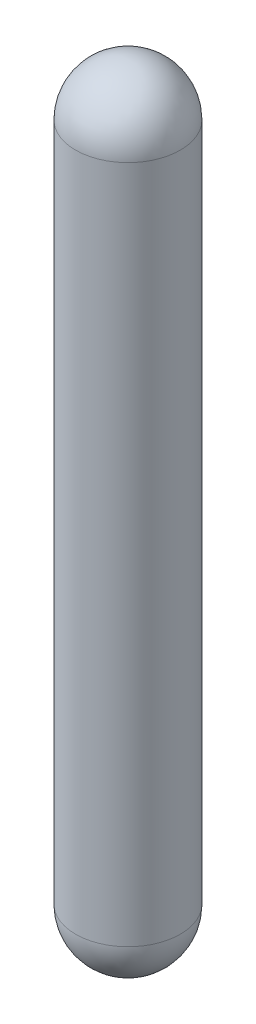
ISO-10303-21;
HEADER;
FILE_DESCRIPTION(('STEP AP214'),'2;1');
FILE_NAME('part.step','',(''),(''),'','','');
FILE_SCHEMA(('AUTOMOTIVE_DESIGN { 1 0 10303 214 1 1 1 1 }'));
ENDSEC;
DATA;
#1=APPLICATION_CONTEXT('core data for automotive mechanical design processes');
#2=APPLICATION_PROTOCOL_DEFINITION('international standard','automotive_design',2000,#1);
#3=PRODUCT_CONTEXT('',#1,'mechanical');
#4=PRODUCT('Part','Part','',(#3));
#5=PRODUCT_RELATED_PRODUCT_CATEGORY('part','',(#4));
#6=PRODUCT_DEFINITION_FORMATION('','',#4);
#7=PRODUCT_DEFINITION_CONTEXT('part definition',#1,'design');
#8=PRODUCT_DEFINITION('design','',#6,#7);
#9=PRODUCT_DEFINITION_SHAPE('','',#8);
#10=(LENGTH_UNIT() NAMED_UNIT(*) SI_UNIT(.MILLI.,.METRE.));
#11=(NAMED_UNIT(*) PLANE_ANGLE_UNIT() SI_UNIT($,.RADIAN.));
#12=(NAMED_UNIT(*) SI_UNIT($,.STERADIAN.) SOLID_ANGLE_UNIT());
#13=UNCERTAINTY_MEASURE_WITH_UNIT(LENGTH_MEASURE(1.E-05),#10,'distance_accuracy_value','');
#14=(GEOMETRIC_REPRESENTATION_CONTEXT(3) GLOBAL_UNCERTAINTY_ASSIGNED_CONTEXT((#13)) GLOBAL_UNIT_ASSIGNED_CONTEXT((#10,
#11,#12)) REPRESENTATION_CONTEXT('',''));
#15=CARTESIAN_POINT('',(0.,0.,0.));
#16=DIRECTION('',(0.,0.,1.));
#17=DIRECTION('',(1.,0.,0.));
#18=AXIS2_PLACEMENT_3D('',#15,#16,#17);
#19=CARTESIAN_POINT('',(0.,50.3580155806544,0.));
#20=DIRECTION('',(0.,1.,0.));
#21=DIRECTION('',(0.,0.,1.));
#22=AXIS2_PLACEMENT_3D('',#19,#20,#21);
#23=CYLINDRICAL_SURFACE('',#22,133.35);
#24=CARTESIAN_POINT('',(0.,1729.74,0.));
#25=DIRECTION('',(0.,1.,0.));
#26=DIRECTION('',(0.,0.,1.));
#27=AXIS2_PLACEMENT_3D('',#24,#25,#26);
#28=CIRCLE('',#27,133.35);
#29=CARTESIAN_POINT('',(0.,1729.74,133.35));
#30=VERTEX_POINT('',#29);
#31=EDGE_CURVE('E71',#30,#30,#28,.T.);
#32=ORIENTED_EDGE('',*,*,#31,.F.);
#33=EDGE_LOOP('',(#32));
#34=FACE_BOUND('',#33,.T.);
#35=CARTESIAN_POINT('',(0.,0.,0.));
#36=DIRECTION('',(0.,1.,0.));
#37=DIRECTION('',(0.,0.,1.));
#38=AXIS2_PLACEMENT_3D('',#35,#36,#37);
#39=CIRCLE('',#38,133.35);
#40=CARTESIAN_POINT('',(0.,0.,133.35));
#41=VERTEX_POINT('',#40);
#42=EDGE_CURVE('E11',#41,#41,#39,.T.);
#43=ORIENTED_EDGE('',*,*,#42,.T.);
#44=EDGE_LOOP('',(#43));
#45=FACE_BOUND('',#44,.T.);
#46=ADVANCED_FACE('F49',(#34,#45),#23,.T.);
#47=CARTESIAN_POINT('',(0.,0.,0.));
#48=DIRECTION('',(0.,1.,0.));
#49=DIRECTION('',(-1.,0.,0.));
#50=AXIS2_PLACEMENT_3D('',#47,#48,#49);
#51=SPHERICAL_SURFACE('',#50,133.35);
#52=CARTESIAN_POINT('',(0.,-133.198723717609,0.));
#53=DIRECTION('',(0.,1.,0.));
#54=DIRECTION('',(0.,0.,1.));
#55=AXIS2_PLACEMENT_3D('',#52,#53,#54);
#56=CIRCLE('',#55,6.34999999999997);
#57=CARTESIAN_POINT('',(0.,-133.198723717609,6.34999999999997));
#58=VERTEX_POINT('',#57);
#59=EDGE_CURVE('E55',#58,#58,#56,.T.);
#60=ORIENTED_EDGE('',*,*,#59,.T.);
#61=EDGE_LOOP('',(#60));
#62=FACE_BOUND('',#61,.T.);
#63=ORIENTED_EDGE('',*,*,#42,.F.);
#64=EDGE_LOOP('',(#63));
#65=FACE_BOUND('',#64,.T.);
#66=ADVANCED_FACE('F78',(#62,#65),#51,.T.);
#67=CARTESIAN_POINT('',(0.,50.3580155806544,0.));
#68=DIRECTION('',(0.,1.,0.));
#69=DIRECTION('',(0.,0.,1.));
#70=AXIS2_PLACEMENT_3D('',#67,#68,#69);
#71=CYLINDRICAL_SURFACE('',#70,6.34999999999997);
#72=CARTESIAN_POINT('',(0.,-129.867447848797,0.));
#73=DIRECTION('',(0.,1.,0.));
#74=DIRECTION('',(0.,0.,1.));
#75=AXIS2_PLACEMENT_3D('',#72,#73,#74);
#76=CIRCLE('',#75,6.34999999999997);
#77=CARTESIAN_POINT('',(0.,-129.867447848797,6.34999999999997));
#78=VERTEX_POINT('',#77);
#79=EDGE_CURVE('E59',#78,#78,#76,.T.);
#80=ORIENTED_EDGE('',*,*,#79,.T.);
#81=EDGE_LOOP('',(#80));
#82=FACE_BOUND('',#81,.T.);
#83=ORIENTED_EDGE('',*,*,#59,.F.);
#84=EDGE_LOOP('',(#83));
#85=FACE_BOUND('',#84,.T.);
#86=ADVANCED_FACE('F82',(#82,#85),#71,.F.);
#87=CARTESIAN_POINT('',(0.,0.,0.));
#88=DIRECTION('',(0.,1.,0.));
#89=DIRECTION('',(-1.,0.,0.));
#90=AXIS2_PLACEMENT_3D('',#87,#88,#89);
#91=SPHERICAL_SURFACE('',#90,130.0226);
#92=ORIENTED_EDGE('',*,*,#79,.F.);
#93=EDGE_LOOP('',(#92));
#94=FACE_BOUND('',#93,.T.);
#95=CARTESIAN_POINT('',(0.,0.,0.));
#96=DIRECTION('',(0.,1.,0.));
#97=DIRECTION('',(0.,0.,1.));
#98=AXIS2_PLACEMENT_3D('',#95,#96,#97);
#99=CIRCLE('',#98,130.0226);
#100=CARTESIAN_POINT('',(0.,0.,130.0226));
#101=VERTEX_POINT('',#100);
#102=EDGE_CURVE('E63',#101,#101,#99,.T.);
#103=ORIENTED_EDGE('',*,*,#102,.T.);
#104=EDGE_LOOP('',(#103));
#105=FACE_BOUND('',#104,.T.);
#106=ADVANCED_FACE('F86',(#94,#105),#91,.F.);
#107=CARTESIAN_POINT('',(0.,50.3580155806544,0.));
#108=DIRECTION('',(0.,1.,0.));
#109=DIRECTION('',(0.,0.,1.));
#110=AXIS2_PLACEMENT_3D('',#107,#108,#109);
#111=CYLINDRICAL_SURFACE('',#110,130.0226);
#112=ORIENTED_EDGE('',*,*,#102,.F.);
#113=EDGE_LOOP('',(#112));
#114=FACE_BOUND('',#113,.T.);
#115=CARTESIAN_POINT('',(0.,1729.74,0.));
#116=DIRECTION('',(0.,1.,0.));
#117=DIRECTION('',(0.,0.,1.));
#118=AXIS2_PLACEMENT_3D('',#115,#116,#117);
#119=CIRCLE('',#118,130.0226);
#120=CARTESIAN_POINT('',(0.,1729.74,130.0226));
#121=VERTEX_POINT('',#120);
#122=EDGE_CURVE('E68',#121,#121,#119,.T.);
#123=ORIENTED_EDGE('',*,*,#122,.T.);
#124=EDGE_LOOP('',(#123));
#125=FACE_BOUND('',#124,.T.);
#126=ADVANCED_FACE('F93',(#114,#125),#111,.F.);
#127=CARTESIAN_POINT('',(-2.08166817117217E-13,1729.74,0.));
#128=DIRECTION('',(0.,1.,0.));
#129=DIRECTION('',(-1.,0.,0.));
#130=AXIS2_PLACEMENT_3D('',#127,#128,#129);
#131=SPHERICAL_SURFACE('',#130,130.0226);
#132=ORIENTED_EDGE('',*,*,#122,.F.);
#133=EDGE_LOOP('',(#132));
#134=FACE_BOUND('',#133,.T.);
#135=ADVANCED_FACE('F97',(#134),#131,.F.);
#136=CARTESIAN_POINT('',(-2.08166817117217E-13,1729.74,0.));
#137=DIRECTION('',(0.,1.,0.));
#138=DIRECTION('',(-1.,0.,0.));
#139=AXIS2_PLACEMENT_3D('',#136,#137,#138);
#140=SPHERICAL_SURFACE('',#139,133.35);
#141=ORIENTED_EDGE('',*,*,#31,.T.);
#142=EDGE_LOOP('',(#141));
#143=FACE_BOUND('',#142,.T.);
#144=ADVANCED_FACE('F75',(#143),#140,.T.);
#145=CLOSED_SHELL('',(#46,#66,#86,#106,#126,#135,#144));
#146=MANIFOLD_SOLID_BREP('B2',#145);
#147=CARTESIAN_POINT('',(0.,50.3580155806544,0.));
#148=DIRECTION('',(0.,1.,0.));
#149=DIRECTION('',(0.,0.,1.));
#150=AXIS2_PLACEMENT_3D('',#147,#148,#149);
#151=CYLINDRICAL_SURFACE('',#150,130.0226);
#152=CARTESIAN_POINT('',(0.,0.,0.));
#153=DIRECTION('',(0.,1.,0.));
#154=DIRECTION('',(0.,0.,1.));
#155=AXIS2_PLACEMENT_3D('',#152,#153,#154);
#156=CIRCLE('',#155,130.0226);
#157=CARTESIAN_POINT('',(0.,0.,130.0226));
#158=VERTEX_POINT('',#157);
#159=EDGE_CURVE('E48',#158,#158,#156,.T.);
#160=ORIENTED_EDGE('',*,*,#159,.T.);
#161=EDGE_LOOP('',(#160));
#162=FACE_BOUND('',#161,.T.);
#163=CARTESIAN_POINT('',(0.,1729.74,0.));
#164=DIRECTION('',(0.,1.,0.));
#165=DIRECTION('',(0.,0.,1.));
#166=AXIS2_PLACEMENT_3D('',#163,#164,#165);
#167=CIRCLE('',#166,130.0226);
#168=CARTESIAN_POINT('',(0.,1729.74,130.0226));
#169=VERTEX_POINT('',#168);
#170=EDGE_CURVE('E185',#169,#169,#167,.T.);
#171=ORIENTED_EDGE('',*,*,#170,.F.);
#172=EDGE_LOOP('',(#171));
#173=FACE_BOUND('',#172,.T.);
#174=ADVANCED_FACE('F150',(#162,#173),#151,.T.);
#175=CARTESIAN_POINT('',(0.,0.,0.));
#176=DIRECTION('',(0.,1.,0.));
#177=DIRECTION('',(-1.,0.,0.));
#178=AXIS2_PLACEMENT_3D('',#175,#176,#177);
#179=SPHERICAL_SURFACE('',#178,130.0226);
#180=CARTESIAN_POINT('',(0.,-129.867447848797,0.));
#181=DIRECTION('',(0.,1.,0.));
#182=DIRECTION('',(0.,0.,1.));
#183=AXIS2_PLACEMENT_3D('',#180,#181,#182);
#184=CIRCLE('',#183,6.34999999999997);
#185=CARTESIAN_POINT('',(0.,-129.867447848797,6.34999999999997));
#186=VERTEX_POINT('',#185);
#187=EDGE_CURVE('E157',#186,#186,#184,.T.);
#188=ORIENTED_EDGE('',*,*,#187,.T.);
#189=EDGE_LOOP('',(#188));
#190=FACE_BOUND('',#189,.T.);
#191=ORIENTED_EDGE('',*,*,#159,.F.);
#192=EDGE_LOOP('',(#191));
#193=FACE_BOUND('',#192,.T.);
#194=ADVANCED_FACE('F193',(#190,#193),#179,.T.);
#195=CARTESIAN_POINT('',(0.,50.3580155806544,0.));
#196=DIRECTION('',(0.,1.,0.));
#197=DIRECTION('',(0.,0.,1.));
#198=AXIS2_PLACEMENT_3D('',#195,#196,#197);
#199=CYLINDRICAL_SURFACE('',#198,6.34999999999997);
#200=ORIENTED_EDGE('',*,*,#187,.F.);
#201=EDGE_LOOP('',(#200));
#202=FACE_BOUND('',#201,.T.);
#203=CARTESIAN_POINT('',(0.,-158.598723717609,0.));
#204=DIRECTION('',(0.,1.,0.));
#205=DIRECTION('',(0.,0.,1.));
#206=AXIS2_PLACEMENT_3D('',#203,#204,#205);
#207=CIRCLE('',#206,6.34999999999997);
#208=CARTESIAN_POINT('',(0.,-158.598723717609,6.34999999999997));
#209=VERTEX_POINT('',#208);
#210=EDGE_CURVE('E162',#209,#209,#207,.T.);
#211=ORIENTED_EDGE('',*,*,#210,.T.);
#212=EDGE_LOOP('',(#211));
#213=FACE_BOUND('',#212,.T.);
#214=ADVANCED_FACE('F197',(#202,#213),#199,.T.);
#215=CARTESIAN_POINT('',(0.,-158.598723717609,0.));
#216=DIRECTION('',(0.,1.,0.));
#217=DIRECTION('',(0.,0.,1.));
#218=AXIS2_PLACEMENT_3D('',#215,#216,#217);
#219=PLANE('',#218);
#220=ORIENTED_EDGE('',*,*,#210,.F.);
#221=EDGE_LOOP('',(#220));
#222=FACE_BOUND('',#221,.T.);
#223=CARTESIAN_POINT('',(0.,-158.598723717609,0.));
#224=DIRECTION('',(0.,1.,0.));
#225=DIRECTION('',(0.,0.,1.));
#226=AXIS2_PLACEMENT_3D('',#223,#224,#225);
#227=CIRCLE('',#226,3.17499999999997);
#228=CARTESIAN_POINT('',(0.,-158.598723717609,3.17499999999997));
#229=VERTEX_POINT('',#228);
#230=EDGE_CURVE('E167',#229,#229,#227,.T.);
#231=ORIENTED_EDGE('',*,*,#230,.T.);
#232=EDGE_LOOP('',(#231));
#233=FACE_BOUND('',#232,.T.);
#234=ADVANCED_FACE('F201',(#222,#233),#219,.F.);
#235=CARTESIAN_POINT('',(0.,50.3580155806544,0.));
#236=DIRECTION('',(0.,1.,0.));
#237=DIRECTION('',(0.,0.,1.));
#238=AXIS2_PLACEMENT_3D('',#235,#236,#237);
#239=CYLINDRICAL_SURFACE('',#238,3.17499999999998);
#240=ORIENTED_EDGE('',*,*,#230,.F.);
#241=EDGE_LOOP('',(#240));
#242=FACE_BOUND('',#241,.T.);
#243=CARTESIAN_POINT('',(0.,-114.738679780447,0.));
#244=DIRECTION('',(0.,1.,0.));
#245=DIRECTION('',(0.,0.,1.));
#246=AXIS2_PLACEMENT_3D('',#243,#244,#245);
#247=CIRCLE('',#246,3.17499999999998);
#248=CARTESIAN_POINT('',(0.,-114.738679780447,3.17499999999998));
#249=VERTEX_POINT('',#248);
#250=EDGE_CURVE('E173',#249,#249,#247,.T.);
#251=ORIENTED_EDGE('',*,*,#250,.T.);
#252=EDGE_LOOP('',(#251));
#253=FACE_BOUND('',#252,.T.);
#254=ADVANCED_FACE('F208',(#242,#253),#239,.F.);
#255=CARTESIAN_POINT('',(0.,0.,0.));
#256=DIRECTION('',(0.,1.,0.));
#257=DIRECTION('',(-1.,0.,0.));
#258=AXIS2_PLACEMENT_3D('',#255,#256,#257);
#259=SPHERICAL_SURFACE('',#258,114.7826);
#260=ORIENTED_EDGE('',*,*,#250,.F.);
#261=EDGE_LOOP('',(#260));
#262=FACE_BOUND('',#261,.T.);
#263=CARTESIAN_POINT('',(0.,0.,0.));
#264=DIRECTION('',(0.,1.,0.));
#265=DIRECTION('',(0.,0.,1.));
#266=AXIS2_PLACEMENT_3D('',#263,#264,#265);
#267=CIRCLE('',#266,114.7826);
#268=CARTESIAN_POINT('',(0.,0.,114.7826));
#269=VERTEX_POINT('',#268);
#270=EDGE_CURVE('E177',#269,#269,#267,.T.);
#271=ORIENTED_EDGE('',*,*,#270,.T.);
#272=EDGE_LOOP('',(#271));
#273=FACE_BOUND('',#272,.T.);
#274=ADVANCED_FACE('F212',(#262,#273),#259,.F.);
#275=CARTESIAN_POINT('',(0.,50.3580155806544,0.));
#276=DIRECTION('',(0.,1.,0.));
#277=DIRECTION('',(0.,0.,1.));
#278=AXIS2_PLACEMENT_3D('',#275,#276,#277);
#279=CYLINDRICAL_SURFACE('',#278,114.7826);
#280=ORIENTED_EDGE('',*,*,#270,.F.);
#281=EDGE_LOOP('',(#280));
#282=FACE_BOUND('',#281,.T.);
#283=CARTESIAN_POINT('',(0.,1729.74,0.));
#284=DIRECTION('',(0.,1.,0.));
#285=DIRECTION('',(0.,0.,1.));
#286=AXIS2_PLACEMENT_3D('',#283,#284,#285);
#287=CIRCLE('',#286,114.7826);
#288=CARTESIAN_POINT('',(0.,1729.74,114.7826));
#289=VERTEX_POINT('',#288);
#290=EDGE_CURVE('E181',#289,#289,#287,.T.);
#291=ORIENTED_EDGE('',*,*,#290,.T.);
#292=EDGE_LOOP('',(#291));
#293=FACE_BOUND('',#292,.T.);
#294=ADVANCED_FACE('F216',(#282,#293),#279,.F.);
#295=CARTESIAN_POINT('',(-2.08166817117217E-13,1729.74,0.));
#296=DIRECTION('',(0.,1.,0.));
#297=DIRECTION('',(-1.,0.,0.));
#298=AXIS2_PLACEMENT_3D('',#295,#296,#297);
#299=SPHERICAL_SURFACE('',#298,114.7826);
#300=ORIENTED_EDGE('',*,*,#290,.F.);
#301=EDGE_LOOP('',(#300));
#302=FACE_BOUND('',#301,.T.);
#303=ADVANCED_FACE('F220',(#302),#299,.F.);
#304=CARTESIAN_POINT('',(-2.08166817117217E-13,1729.74,0.));
#305=DIRECTION('',(0.,1.,0.));
#306=DIRECTION('',(-1.,0.,0.));
#307=AXIS2_PLACEMENT_3D('',#304,#305,#306);
#308=SPHERICAL_SURFACE('',#307,130.0226);
#309=ORIENTED_EDGE('',*,*,#170,.T.);
#310=EDGE_LOOP('',(#309));
#311=FACE_BOUND('',#310,.T.);
#312=ADVANCED_FACE('F190',(#311),#308,.T.);
#313=CLOSED_SHELL('',(#174,#194,#214,#234,#254,#274,#294,#303,#312));
#314=MANIFOLD_SOLID_BREP('B6',#313);
#315=ADVANCED_BREP_SHAPE_REPRESENTATION('',(#18,#146,#314),#14);
#316=SHAPE_DEFINITION_REPRESENTATION(#9,#315);
ENDSEC;
END-ISO-10303-21;
